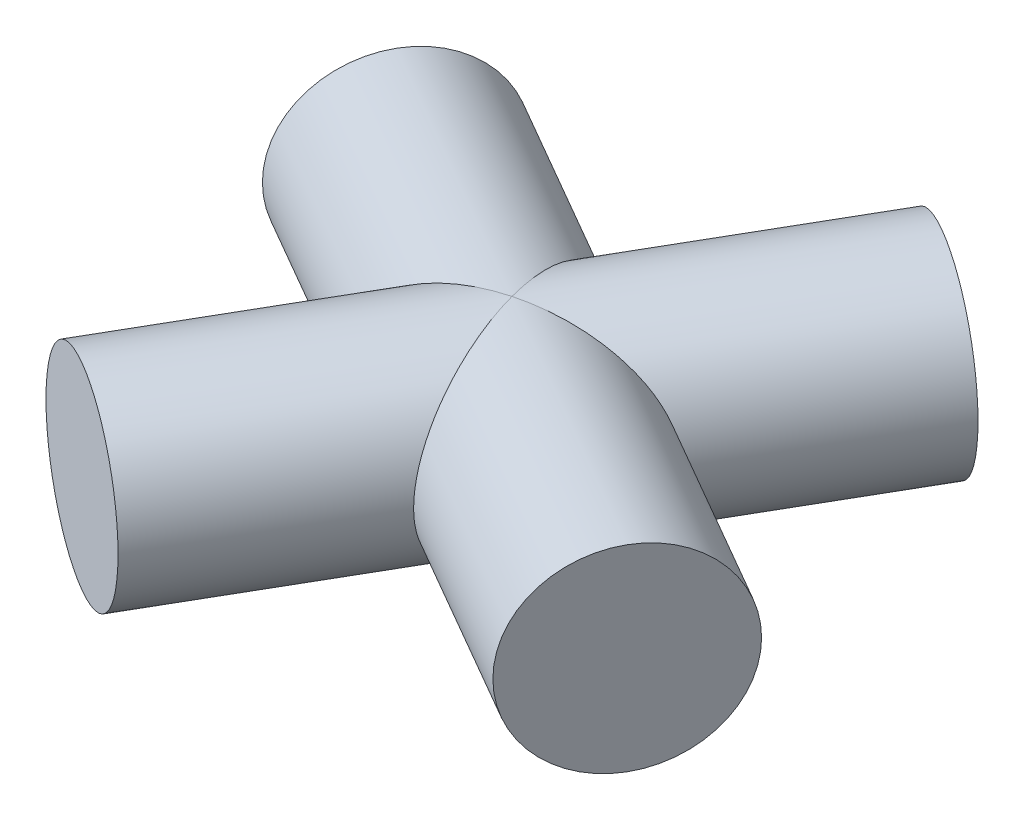
ISO-10303-21;
HEADER;
FILE_DESCRIPTION(('STEP AP214'),'2;1');
FILE_NAME('part.step','',(''),(''),'','','');
FILE_SCHEMA(('AUTOMOTIVE_DESIGN { 1 0 10303 214 1 1 1 1 }'));
ENDSEC;
DATA;
#1=APPLICATION_CONTEXT('core data for automotive mechanical design processes');
#2=APPLICATION_PROTOCOL_DEFINITION('international standard','automotive_design',2000,#1);
#3=PRODUCT_CONTEXT('',#1,'mechanical');
#4=PRODUCT('Part','Part','',(#3));
#5=PRODUCT_RELATED_PRODUCT_CATEGORY('part','',(#4));
#6=PRODUCT_DEFINITION_FORMATION('','',#4);
#7=PRODUCT_DEFINITION_CONTEXT('part definition',#1,'design');
#8=PRODUCT_DEFINITION('design','',#6,#7);
#9=PRODUCT_DEFINITION_SHAPE('','',#8);
#10=(LENGTH_UNIT() NAMED_UNIT(*) SI_UNIT(.MILLI.,.METRE.));
#11=(NAMED_UNIT(*) PLANE_ANGLE_UNIT() SI_UNIT($,.RADIAN.));
#12=(NAMED_UNIT(*) SI_UNIT($,.STERADIAN.) SOLID_ANGLE_UNIT());
#13=UNCERTAINTY_MEASURE_WITH_UNIT(LENGTH_MEASURE(1.E-05),#10,'distance_accuracy_value','');
#14=(GEOMETRIC_REPRESENTATION_CONTEXT(3) GLOBAL_UNCERTAINTY_ASSIGNED_CONTEXT((#13)) GLOBAL_UNIT_ASSIGNED_CONTEXT((#10,
#11,#12)) REPRESENTATION_CONTEXT('',''));
#15=CARTESIAN_POINT('',(0.,0.,0.));
#16=DIRECTION('',(0.,0.,1.));
#17=DIRECTION('',(1.,0.,0.));
#18=AXIS2_PLACEMENT_3D('',#15,#16,#17);
#19=CARTESIAN_POINT('',(37.8818839059327,71.0000000000002,-65.6133476115012));
#20=DIRECTION('',(-0.5,0.,0.866025403784439));
#21=DIRECTION('',(0.866025403784439,0.,0.5));
#22=AXIS2_PLACEMENT_3D('',#19,#20,#21);
#23=CYLINDRICAL_SURFACE('',#22,2.5);
#24=CARTESIAN_POINT('',(30.34635,71.0000000000002,-52.5614200242678));
#25=DIRECTION('',(0.258819045102521,0.,0.965925826289068));
#26=DIRECTION('',(-0.965925826289068,0.,0.258819045102521));
#27=AXIS2_PLACEMENT_3D('',#24,#25,#26);
#28=ELLIPSE('',#27,3.53553390593273,2.5);
#29=CARTESIAN_POINT('',(30.34635,68.5000000000002,-52.5614200242678));
#30=VERTEX_POINT('',#29);
#31=CARTESIAN_POINT('',(30.34635,73.5000000000002,-52.5614200242678));
#32=VERTEX_POINT('',#31);
#33=EDGE_CURVE('E53',#30,#32,#28,.T.);
#34=ORIENTED_EDGE('',*,*,#33,.F.);
#35=CARTESIAN_POINT('',(30.34635,71.0000000000002,-52.5614200242678));
#36=DIRECTION('',(-0.965925826289068,0.,0.258819045102521));
#37=DIRECTION('',(0.258819045102521,0.,0.965925826289068));
#38=AXIS2_PLACEMENT_3D('',#35,#36,#37);
#39=ELLIPSE('',#38,3.53553390593273,2.5);
#40=EDGE_CURVE('E65',#32,#30,#39,.T.);
#41=ORIENTED_EDGE('',*,*,#40,.F.);
#42=EDGE_LOOP('',(#34,#41));
#43=FACE_BOUND('',#42,.T.);
#44=CARTESIAN_POINT('',(34.34635,71.0000000000002,-59.4896232545433));
#45=DIRECTION('',(-0.5,0.,0.866025403784439));
#46=DIRECTION('',(0.866025403784439,0.,0.5));
#47=AXIS2_PLACEMENT_3D('',#44,#45,#46);
#48=CIRCLE('',#47,2.5);
#49=CARTESIAN_POINT('',(36.5114135094611,71.0000000000002,-58.2396232545433));
#50=VERTEX_POINT('',#49);
#51=EDGE_CURVE('E74',#50,#50,#48,.F.);
#52=ORIENTED_EDGE('',*,*,#51,.F.);
#53=EDGE_LOOP('',(#52));
#54=FACE_BOUND('',#53,.T.);
#55=ADVANCED_FACE('F45',(#43,#54),#23,.T.);
#56=CARTESIAN_POINT('',(30.8822483848622,75.,-61.4896232545433));
#57=DIRECTION('',(-0.5,0.,0.866025403784439));
#58=DIRECTION('',(0.866025403784439,0.,0.5));
#59=AXIS2_PLACEMENT_3D('',#56,#57,#58);
#60=PLANE('',#59);
#61=ORIENTED_EDGE('',*,*,#51,.T.);
#62=EDGE_LOOP('',(#61));
#63=FACE_BOUND('',#62,.T.);
#64=ADVANCED_FACE('F102',(#63),#60,.F.);
#65=CARTESIAN_POINT('',(37.2745532302755,71.0000000000001,-48.5614200242678));
#66=DIRECTION('',(0.866025403784439,0.,0.5));
#67=DIRECTION('',(0.5,0.,-0.866025403784439));
#68=AXIS2_PLACEMENT_3D('',#65,#66,#67);
#69=PLANE('',#68);
#70=CARTESIAN_POINT('',(37.2745532302755,71.0000000000001,-48.5614200242678));
#71=DIRECTION('',(0.866025403784439,0.,0.5));
#72=DIRECTION('',(0.5,0.,-0.866025403784439));
#73=AXIS2_PLACEMENT_3D('',#70,#71,#72);
#74=CIRCLE('',#73,2.5);
#75=CARTESIAN_POINT('',(38.5245532302755,71.0000000000001,-50.7264835337289));
#76=VERTEX_POINT('',#75);
#77=EDGE_CURVE('E89',#76,#76,#74,.T.);
#78=ORIENTED_EDGE('',*,*,#77,.T.);
#79=EDGE_LOOP('',(#78));
#80=FACE_BOUND('',#79,.T.);
#81=ADVANCED_FACE('F109',(#80),#69,.T.);
#82=CARTESIAN_POINT('',(23.4181467697245,71.0000000000001,-56.5614200242678));
#83=DIRECTION('',(0.866025403784439,0.,0.5));
#84=DIRECTION('',(0.5,0.,-0.866025403784439));
#85=AXIS2_PLACEMENT_3D('',#82,#83,#84);
#86=CYLINDRICAL_SURFACE('',#85,2.5);
#87=ORIENTED_EDGE('',*,*,#77,.F.);
#88=EDGE_LOOP('',(#87));
#89=FACE_BOUND('',#88,.T.);
#90=CARTESIAN_POINT('',(30.34635,71.0000000000002,-52.5614200242678));
#91=DIRECTION('',(-0.965925826289068,0.,0.258819045102521));
#92=DIRECTION('',(0.258819045102521,0.,0.965925826289068));
#93=AXIS2_PLACEMENT_3D('',#90,#91,#92);
#94=ELLIPSE('',#93,3.53553390593273,2.5);
#95=EDGE_CURVE('E59',#32,#30,#94,.F.);
#96=ORIENTED_EDGE('',*,*,#95,.T.);
#97=ORIENTED_EDGE('',*,*,#33,.T.);
#98=EDGE_LOOP('',(#96,#97));
#99=FACE_BOUND('',#98,.T.);
#100=ADVANCED_FACE('F76',(#89,#99),#86,.T.);
#101=CARTESIAN_POINT('',(26.34635,71.0000000000002,-45.6332167939923));
#102=DIRECTION('',(-0.5,0.,0.866025403784439));
#103=DIRECTION('',(0.866025403784439,0.,0.5));
#104=AXIS2_PLACEMENT_3D('',#101,#102,#103);
#105=PLANE('',#104);
#106=CARTESIAN_POINT('',(26.34635,71.0000000000002,-45.6332167939923));
#107=DIRECTION('',(-0.5,0.,0.866025403784439));
#108=DIRECTION('',(0.866025403784439,0.,0.5));
#109=AXIS2_PLACEMENT_3D('',#106,#107,#108);
#110=CIRCLE('',#109,2.5);
#111=CARTESIAN_POINT('',(28.5114135094611,71.0000000000002,-44.3832167939923));
#112=VERTEX_POINT('',#111);
#113=EDGE_CURVE('E88',#112,#112,#110,.T.);
#114=ORIENTED_EDGE('',*,*,#113,.T.);
#115=EDGE_LOOP('',(#114));
#116=FACE_BOUND('',#115,.T.);
#117=ADVANCED_FACE('F112',(#116),#105,.T.);
#118=CARTESIAN_POINT('',(30.34635,71.0000000000002,-52.5614200242678));
#119=DIRECTION('',(0.258819045102521,0.,0.965925826289068));
#120=DIRECTION('',(-0.965925826289068,0.,0.258819045102521));
#121=AXIS2_PLACEMENT_3D('',#118,#119,#120);
#122=ELLIPSE('',#121,3.53553390593273,2.5);
#123=EDGE_CURVE('E11',#30,#32,#122,.F.);
#124=ORIENTED_EDGE('',*,*,#123,.F.);
#125=ORIENTED_EDGE('',*,*,#95,.F.);
#126=EDGE_LOOP('',(#124,#125));
#127=FACE_BOUND('',#126,.T.);
#128=ORIENTED_EDGE('',*,*,#113,.F.);
#129=EDGE_LOOP('',(#128));
#130=FACE_BOUND('',#129,.T.);
#131=ADVANCED_FACE('F71',(#127,#130),#23,.T.);
#132=ORIENTED_EDGE('',*,*,#40,.T.);
#133=ORIENTED_EDGE('',*,*,#123,.T.);
#134=EDGE_LOOP('',(#132,#133));
#135=FACE_BOUND('',#134,.T.);
#136=CARTESIAN_POINT('',(23.4181467697245,71.0000000000001,-56.5614200242678));
#137=DIRECTION('',(0.866025403784439,0.,0.5));
#138=DIRECTION('',(0.5,0.,-0.866025403784439));
#139=AXIS2_PLACEMENT_3D('',#136,#137,#138);
#140=CIRCLE('',#139,2.5);
#141=CARTESIAN_POINT('',(24.6681467697245,71.0000000000001,-58.7264835337289));
#142=VERTEX_POINT('',#141);
#143=EDGE_CURVE('E85',#142,#142,#140,.T.);
#144=ORIENTED_EDGE('',*,*,#143,.T.);
#145=EDGE_LOOP('',(#144));
#146=FACE_BOUND('',#145,.T.);
#147=ADVANCED_FACE('F78',(#135,#146),#86,.T.);
#148=CARTESIAN_POINT('',(23.4181467697245,71.0000000000001,-56.5614200242678));
#149=DIRECTION('',(0.866025403784439,0.,0.5));
#150=DIRECTION('',(0.5,0.,-0.866025403784439));
#151=AXIS2_PLACEMENT_3D('',#148,#149,#150);
#152=PLANE('',#151);
#153=ORIENTED_EDGE('',*,*,#143,.F.);
#154=EDGE_LOOP('',(#153));
#155=FACE_BOUND('',#154,.T.);
#156=ADVANCED_FACE('F81',(#155),#152,.F.);
#157=CLOSED_SHELL('',(#55,#64,#81,#100,#117,#131,#147,#156));
#158=MANIFOLD_SOLID_BREP('B2',#157);
#159=ADVANCED_BREP_SHAPE_REPRESENTATION('',(#18,#158),#14);
#160=SHAPE_DEFINITION_REPRESENTATION(#9,#159);
ENDSEC;
END-ISO-10303-21;
